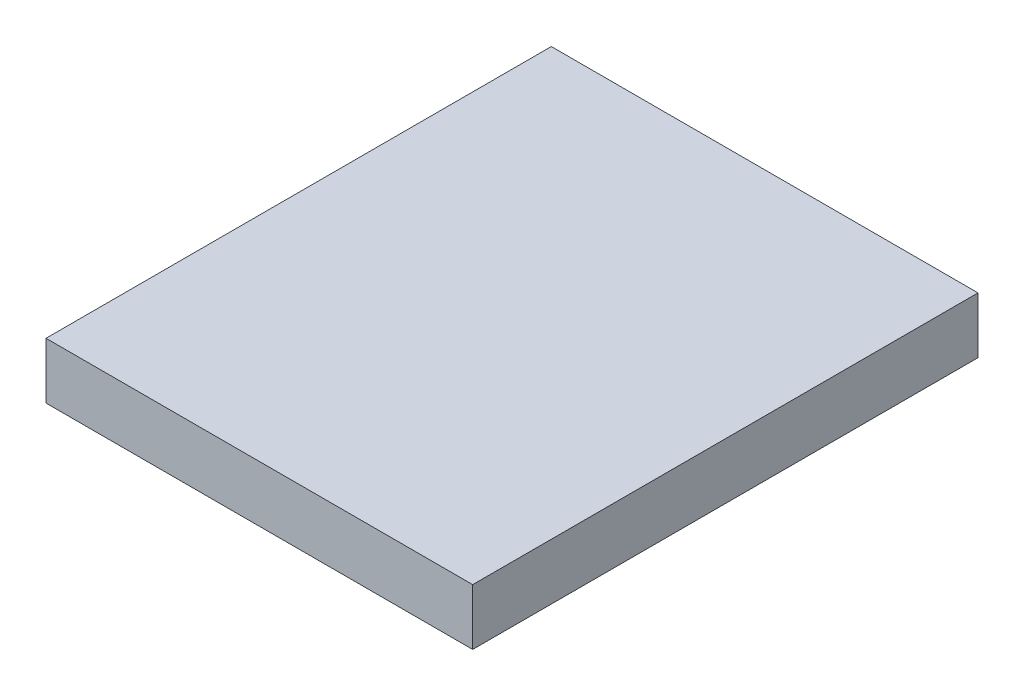
ISO-10303-21;
HEADER;
FILE_DESCRIPTION(('STEP AP214'),'2;1');
FILE_NAME('part.step','',(''),(''),'','','');
FILE_SCHEMA(('AUTOMOTIVE_DESIGN { 1 0 10303 214 1 1 1 1 }'));
ENDSEC;
DATA;
#1=APPLICATION_CONTEXT('core data for automotive mechanical design processes');
#2=APPLICATION_PROTOCOL_DEFINITION('international standard','automotive_design',2000,#1);
#3=PRODUCT_CONTEXT('',#1,'mechanical');
#4=PRODUCT('Part','Part','',(#3));
#5=PRODUCT_RELATED_PRODUCT_CATEGORY('part','',(#4));
#6=PRODUCT_DEFINITION_FORMATION('','',#4);
#7=PRODUCT_DEFINITION_CONTEXT('part definition',#1,'design');
#8=PRODUCT_DEFINITION('design','',#6,#7);
#9=PRODUCT_DEFINITION_SHAPE('','',#8);
#10=(LENGTH_UNIT() NAMED_UNIT(*) SI_UNIT(.MILLI.,.METRE.));
#11=(NAMED_UNIT(*) PLANE_ANGLE_UNIT() SI_UNIT($,.RADIAN.));
#12=(NAMED_UNIT(*) SI_UNIT($,.STERADIAN.) SOLID_ANGLE_UNIT());
#13=UNCERTAINTY_MEASURE_WITH_UNIT(LENGTH_MEASURE(1.E-05),#10,'distance_accuracy_value','');
#14=(GEOMETRIC_REPRESENTATION_CONTEXT(3) GLOBAL_UNCERTAINTY_ASSIGNED_CONTEXT((#13)) GLOBAL_UNIT_ASSIGNED_CONTEXT((#10,
#11,#12)) REPRESENTATION_CONTEXT('',''));
#15=CARTESIAN_POINT('',(0.,0.,0.));
#16=DIRECTION('',(0.,0.,1.));
#17=DIRECTION('',(1.,0.,0.));
#18=AXIS2_PLACEMENT_3D('',#15,#16,#17);
#19=CARTESIAN_POINT('',(-44.4008668030515,10.,-60.2217070864094));
#20=DIRECTION('',(1.,0.,0.));
#21=DIRECTION('',(0.,0.,-1.));
#22=AXIS2_PLACEMENT_3D('',#19,#20,#21);
#23=PLANE('',#22);
#24=DIRECTION('',(0.,0.,1.));
#25=VECTOR('',#24,1.);
#26=CARTESIAN_POINT('',(-44.4008668030515,0.,-60.2217070864094));
#27=LINE('',#26,#25);
#28=CARTESIAN_POINT('',(-44.4008668030515,0.,-60.2217070864094));
#29=VERTEX_POINT('',#28);
#30=CARTESIAN_POINT('',(-44.4008668030515,0.,29.7782929135906));
#31=VERTEX_POINT('',#30);
#32=EDGE_CURVE('E96',#29,#31,#27,.T.);
#33=ORIENTED_EDGE('',*,*,#32,.T.);
#34=DIRECTION('',(0.,-1.,0.));
#35=VECTOR('',#34,1.);
#36=CARTESIAN_POINT('',(-44.4008668030515,10.,29.7782929135906));
#37=LINE('',#36,#35);
#38=CARTESIAN_POINT('',(-44.4008668030515,10.,29.7782929135906));
#39=VERTEX_POINT('',#38);
#40=EDGE_CURVE('E11',#39,#31,#37,.T.);
#41=ORIENTED_EDGE('',*,*,#40,.F.);
#42=DIRECTION('',(0.,0.,1.));
#43=VECTOR('',#42,1.);
#44=CARTESIAN_POINT('',(-44.4008668030515,10.,-60.2217070864094));
#45=LINE('',#44,#43);
#46=CARTESIAN_POINT('',(-44.4008668030515,10.,-60.2217070864094));
#47=VERTEX_POINT('',#46);
#48=EDGE_CURVE('E84',#47,#39,#45,.T.);
#49=ORIENTED_EDGE('',*,*,#48,.F.);
#50=DIRECTION('',(0.,-1.,0.));
#51=VECTOR('',#50,1.);
#52=CARTESIAN_POINT('',(-44.4008668030515,10.,-60.2217070864094));
#53=LINE('',#52,#51);
#54=EDGE_CURVE('E92',#47,#29,#53,.T.);
#55=ORIENTED_EDGE('',*,*,#54,.T.);
#56=EDGE_LOOP('',(#33,#41,#49,#55));
#57=FACE_BOUND('',#56,.T.);
#58=ADVANCED_FACE('F33',(#57),#23,.F.);
#59=CARTESIAN_POINT('',(-44.4008668030515,10.,29.7782929135906));
#60=DIRECTION('',(0.,0.,-1.));
#61=DIRECTION('',(-1.,0.,0.));
#62=AXIS2_PLACEMENT_3D('',#59,#60,#61);
#63=PLANE('',#62);
#64=DIRECTION('',(1.,0.,0.));
#65=VECTOR('',#64,1.);
#66=CARTESIAN_POINT('',(-44.4008668030515,0.,29.7782929135906));
#67=LINE('',#66,#65);
#68=CARTESIAN_POINT('',(31.5991331969485,0.,29.7782929135906));
#69=VERTEX_POINT('',#68);
#70=EDGE_CURVE('E88',#31,#69,#67,.T.);
#71=ORIENTED_EDGE('',*,*,#70,.T.);
#72=DIRECTION('',(0.,-1.,0.));
#73=VECTOR('',#72,1.);
#74=CARTESIAN_POINT('',(31.5991331969485,10.,29.7782929135906));
#75=LINE('',#74,#73);
#76=CARTESIAN_POINT('',(31.5991331969485,10.,29.7782929135906));
#77=VERTEX_POINT('',#76);
#78=EDGE_CURVE('E41',#77,#69,#75,.T.);
#79=ORIENTED_EDGE('',*,*,#78,.F.);
#80=DIRECTION('',(1.,0.,0.));
#81=VECTOR('',#80,1.);
#82=CARTESIAN_POINT('',(-44.4008668030515,10.,29.7782929135906));
#83=LINE('',#82,#81);
#84=EDGE_CURVE('E79',#39,#77,#83,.T.);
#85=ORIENTED_EDGE('',*,*,#84,.F.);
#86=ORIENTED_EDGE('',*,*,#40,.T.);
#87=EDGE_LOOP('',(#71,#79,#85,#86));
#88=FACE_BOUND('',#87,.T.);
#89=ADVANCED_FACE('F87',(#88),#63,.F.);
#90=CARTESIAN_POINT('',(31.5991331969485,10.,-60.2217070864094));
#91=DIRECTION('',(-1.,0.,0.));
#92=DIRECTION('',(0.,0.,1.));
#93=AXIS2_PLACEMENT_3D('',#90,#91,#92);
#94=PLANE('',#93);
#95=DIRECTION('',(0.,0.,-1.));
#96=VECTOR('',#95,1.);
#97=CARTESIAN_POINT('',(31.5991331969485,0.,-60.2217070864094));
#98=LINE('',#97,#96);
#99=CARTESIAN_POINT('',(31.5991331969485,0.,-60.2217070864094));
#100=VERTEX_POINT('',#99);
#101=EDGE_CURVE('E66',#69,#100,#98,.T.);
#102=ORIENTED_EDGE('',*,*,#101,.T.);
#103=DIRECTION('',(0.,-1.,0.));
#104=VECTOR('',#103,1.);
#105=CARTESIAN_POINT('',(31.5991331969485,10.,-60.2217070864094));
#106=LINE('',#105,#104);
#107=CARTESIAN_POINT('',(31.5991331969485,10.,-60.2217070864094));
#108=VERTEX_POINT('',#107);
#109=EDGE_CURVE('E89',#108,#100,#106,.T.);
#110=ORIENTED_EDGE('',*,*,#109,.F.);
#111=DIRECTION('',(0.,0.,-1.));
#112=VECTOR('',#111,1.);
#113=CARTESIAN_POINT('',(31.5991331969485,10.,-60.2217070864094));
#114=LINE('',#113,#112);
#115=EDGE_CURVE('E82',#77,#108,#114,.T.);
#116=ORIENTED_EDGE('',*,*,#115,.F.);
#117=ORIENTED_EDGE('',*,*,#78,.T.);
#118=EDGE_LOOP('',(#102,#110,#116,#117));
#119=FACE_BOUND('',#118,.T.);
#120=ADVANCED_FACE('F90',(#119),#94,.F.);
#121=CARTESIAN_POINT('',(-44.4008668030515,10.,-60.2217070864094));
#122=DIRECTION('',(0.,0.,1.));
#123=DIRECTION('',(1.,0.,0.));
#124=AXIS2_PLACEMENT_3D('',#121,#122,#123);
#125=PLANE('',#124);
#126=DIRECTION('',(-1.,0.,0.));
#127=VECTOR('',#126,1.);
#128=CARTESIAN_POINT('',(-44.4008668030515,0.,-60.2217070864094));
#129=LINE('',#128,#127);
#130=EDGE_CURVE('E72',#100,#29,#129,.T.);
#131=ORIENTED_EDGE('',*,*,#130,.T.);
#132=ORIENTED_EDGE('',*,*,#54,.F.);
#133=DIRECTION('',(-1.,0.,0.));
#134=VECTOR('',#133,1.);
#135=CARTESIAN_POINT('',(-44.4008668030515,10.,-60.2217070864094));
#136=LINE('',#135,#134);
#137=EDGE_CURVE('E49',#108,#47,#136,.T.);
#138=ORIENTED_EDGE('',*,*,#137,.F.);
#139=ORIENTED_EDGE('',*,*,#109,.T.);
#140=EDGE_LOOP('',(#131,#132,#138,#139));
#141=FACE_BOUND('',#140,.T.);
#142=ADVANCED_FACE('F103',(#141),#125,.F.);
#143=CARTESIAN_POINT('',(0.,10.,0.));
#144=DIRECTION('',(0.,1.,0.));
#145=DIRECTION('',(0.,0.,1.));
#146=AXIS2_PLACEMENT_3D('',#143,#144,#145);
#147=PLANE('',#146);
#148=ORIENTED_EDGE('',*,*,#48,.T.);
#149=ORIENTED_EDGE('',*,*,#84,.T.);
#150=ORIENTED_EDGE('',*,*,#115,.T.);
#151=ORIENTED_EDGE('',*,*,#137,.T.);
#152=EDGE_LOOP('',(#148,#149,#150,#151));
#153=FACE_BOUND('',#152,.T.);
#154=ADVANCED_FACE('F80',(#153),#147,.T.);
#155=CARTESIAN_POINT('',(0.,0.,0.));
#156=DIRECTION('',(0.,1.,0.));
#157=DIRECTION('',(0.,0.,1.));
#158=AXIS2_PLACEMENT_3D('',#155,#156,#157);
#159=PLANE('',#158);
#160=ORIENTED_EDGE('',*,*,#32,.F.);
#161=ORIENTED_EDGE('',*,*,#130,.F.);
#162=ORIENTED_EDGE('',*,*,#101,.F.);
#163=ORIENTED_EDGE('',*,*,#70,.F.);
#164=EDGE_LOOP('',(#160,#161,#162,#163));
#165=FACE_BOUND('',#164,.T.);
#166=ADVANCED_FACE('F106',(#165),#159,.F.);
#167=CLOSED_SHELL('',(#58,#89,#120,#142,#154,#166));
#168=MANIFOLD_SOLID_BREP('B2',#167);
#169=ADVANCED_BREP_SHAPE_REPRESENTATION('',(#18,#168),#14);
#170=SHAPE_DEFINITION_REPRESENTATION(#9,#169);
ENDSEC;
END-ISO-10303-21;
